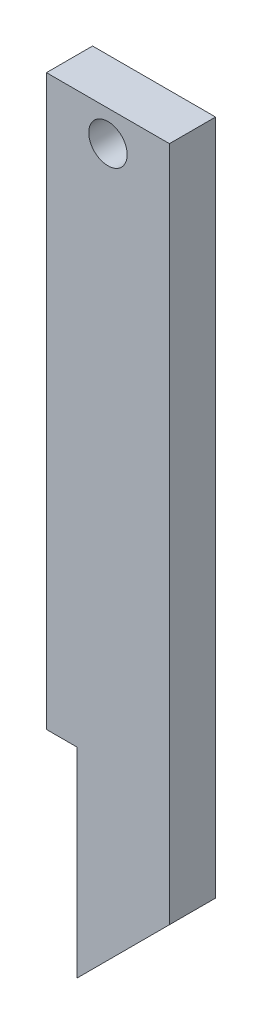
ISO-10303-21;
HEADER;
FILE_DESCRIPTION(('STEP AP214'),'2;1');
FILE_NAME('part.step','',(''),(''),'','','');
FILE_SCHEMA(('AUTOMOTIVE_DESIGN { 1 0 10303 214 1 1 1 1 }'));
ENDSEC;
DATA;
#1=APPLICATION_CONTEXT('core data for automotive mechanical design processes');
#2=APPLICATION_PROTOCOL_DEFINITION('international standard','automotive_design',2000,#1);
#3=PRODUCT_CONTEXT('',#1,'mechanical');
#4=PRODUCT('Part','Part','',(#3));
#5=PRODUCT_RELATED_PRODUCT_CATEGORY('part','',(#4));
#6=PRODUCT_DEFINITION_FORMATION('','',#4);
#7=PRODUCT_DEFINITION_CONTEXT('part definition',#1,'design');
#8=PRODUCT_DEFINITION('design','',#6,#7);
#9=PRODUCT_DEFINITION_SHAPE('','',#8);
#10=(LENGTH_UNIT() NAMED_UNIT(*) SI_UNIT(.MILLI.,.METRE.));
#11=(NAMED_UNIT(*) PLANE_ANGLE_UNIT() SI_UNIT($,.RADIAN.));
#12=(NAMED_UNIT(*) SI_UNIT($,.STERADIAN.) SOLID_ANGLE_UNIT());
#13=UNCERTAINTY_MEASURE_WITH_UNIT(LENGTH_MEASURE(1.E-05),#10,'distance_accuracy_value','');
#14=(GEOMETRIC_REPRESENTATION_CONTEXT(3) GLOBAL_UNCERTAINTY_ASSIGNED_CONTEXT((#13)) GLOBAL_UNIT_ASSIGNED_CONTEXT((#10,
#11,#12)) REPRESENTATION_CONTEXT('',''));
#15=CARTESIAN_POINT('',(0.,0.,0.));
#16=DIRECTION('',(0.,0.,1.));
#17=DIRECTION('',(1.,0.,0.));
#18=AXIS2_PLACEMENT_3D('',#15,#16,#17);
#19=CARTESIAN_POINT('',(-17.553498798299,42.9622619707894,3.));
#20=DIRECTION('',(0.,-1.,0.));
#21=DIRECTION('',(1.,0.,0.));
#22=AXIS2_PLACEMENT_3D('',#19,#20,#21);
#23=PLANE('',#22);
#24=DIRECTION('',(-1.,0.,0.));
#25=VECTOR('',#24,1.);
#26=CARTESIAN_POINT('',(-17.553498798299,42.9622619707894,0.));
#27=LINE('',#26,#25);
#28=CARTESIAN_POINT('',(-9.55349879829899,42.9622619707894,0.));
#29=VERTEX_POINT('',#28);
#30=CARTESIAN_POINT('',(-17.553498798299,42.9622619707894,0.));
#31=VERTEX_POINT('',#30);
#32=EDGE_CURVE('E120',#29,#31,#27,.T.);
#33=ORIENTED_EDGE('',*,*,#32,.T.);
#34=DIRECTION('',(0.,0.,-1.));
#35=VECTOR('',#34,1.);
#36=CARTESIAN_POINT('',(-17.553498798299,42.9622619707894,3.));
#37=LINE('',#36,#35);
#38=CARTESIAN_POINT('',(-17.553498798299,42.9622619707894,3.));
#39=VERTEX_POINT('',#38);
#40=EDGE_CURVE('E11',#39,#31,#37,.T.);
#41=ORIENTED_EDGE('',*,*,#40,.F.);
#42=DIRECTION('',(-1.,0.,0.));
#43=VECTOR('',#42,1.);
#44=CARTESIAN_POINT('',(-17.553498798299,42.9622619707894,3.));
#45=LINE('',#44,#43);
#46=CARTESIAN_POINT('',(-9.55349879829899,42.9622619707894,3.));
#47=VERTEX_POINT('',#46);
#48=EDGE_CURVE('E117',#47,#39,#45,.T.);
#49=ORIENTED_EDGE('',*,*,#48,.F.);
#50=DIRECTION('',(0.,0.,-1.));
#51=VECTOR('',#50,1.);
#52=CARTESIAN_POINT('',(-9.55349879829899,42.9622619707894,3.));
#53=LINE('',#52,#51);
#54=EDGE_CURVE('E124',#47,#29,#53,.T.);
#55=ORIENTED_EDGE('',*,*,#54,.T.);
#56=EDGE_LOOP('',(#33,#41,#49,#55));
#57=FACE_BOUND('',#56,.T.);
#58=ADVANCED_FACE('F33',(#57),#23,.F.);
#59=CARTESIAN_POINT('',(-17.553498798299,42.9622619707894,3.));
#60=DIRECTION('',(1.,0.,0.));
#61=DIRECTION('',(0.,1.,0.));
#62=AXIS2_PLACEMENT_3D('',#59,#60,#61);
#63=PLANE('',#62);
#64=DIRECTION('',(0.,-1.,0.));
#65=VECTOR('',#64,1.);
#66=CARTESIAN_POINT('',(-17.553498798299,42.9622619707894,0.));
#67=LINE('',#66,#65);
#68=CARTESIAN_POINT('',(-17.553498798299,5.96226197078943,0.));
#69=VERTEX_POINT('',#68);
#70=EDGE_CURVE('E115',#31,#69,#67,.T.);
#71=ORIENTED_EDGE('',*,*,#70,.T.);
#72=DIRECTION('',(0.,0.,1.));
#73=VECTOR('',#72,1.);
#74=CARTESIAN_POINT('',(-17.553498798299,5.96226197078943,0.));
#75=LINE('',#74,#73);
#76=CARTESIAN_POINT('',(-17.553498798299,5.96226197078943,3.));
#77=VERTEX_POINT('',#76);
#78=EDGE_CURVE('E139',#69,#77,#75,.T.);
#79=ORIENTED_EDGE('',*,*,#78,.T.);
#80=DIRECTION('',(0.,-1.,0.));
#81=VECTOR('',#80,1.);
#82=CARTESIAN_POINT('',(-17.553498798299,42.9622619707894,3.));
#83=LINE('',#82,#81);
#84=EDGE_CURVE('E79',#39,#77,#83,.T.);
#85=ORIENTED_EDGE('',*,*,#84,.F.);
#86=ORIENTED_EDGE('',*,*,#40,.T.);
#87=EDGE_LOOP('',(#71,#79,#85,#86));
#88=FACE_BOUND('',#87,.T.);
#89=ADVANCED_FACE('F145',(#88),#63,.F.);
#90=CARTESIAN_POINT('',(-17.553498798299,-9.03773802921057,3.));
#91=DIRECTION('',(-0.707106781186549,0.707106781186546,0.));
#92=DIRECTION('',(-0.707106781186546,-0.707106781186549,0.));
#93=AXIS2_PLACEMENT_3D('',#90,#91,#92);
#94=PLANE('',#93);
#95=DIRECTION('',(0.707106781186546,0.707106781186549,0.));
#96=VECTOR('',#95,1.);
#97=CARTESIAN_POINT('',(-17.553498798299,-9.03773802921057,3.));
#98=LINE('',#97,#96);
#99=CARTESIAN_POINT('',(-15.553498798299,-7.03773802921062,3.));
#100=VERTEX_POINT('',#99);
#101=CARTESIAN_POINT('',(-9.55349879829899,-1.03773802921057,3.));
#102=VERTEX_POINT('',#101);
#103=EDGE_CURVE('E110',#100,#102,#98,.T.);
#104=ORIENTED_EDGE('',*,*,#103,.F.);
#105=DIRECTION('',(0.,0.,1.));
#106=VECTOR('',#105,1.);
#107=CARTESIAN_POINT('',(-15.553498798299,-7.03773802921062,0.));
#108=LINE('',#107,#106);
#109=CARTESIAN_POINT('',(-15.553498798299,-7.03773802921062,0.));
#110=VERTEX_POINT('',#109);
#111=EDGE_CURVE('E98',#110,#100,#108,.T.);
#112=ORIENTED_EDGE('',*,*,#111,.F.);
#113=DIRECTION('',(0.707106781186546,0.707106781186549,0.));
#114=VECTOR('',#113,1.);
#115=CARTESIAN_POINT('',(-17.553498798299,-9.03773802921057,0.));
#116=LINE('',#115,#114);
#117=CARTESIAN_POINT('',(-9.55349879829899,-1.03773802921057,0.));
#118=VERTEX_POINT('',#117);
#119=EDGE_CURVE('E109',#110,#118,#116,.T.);
#120=ORIENTED_EDGE('',*,*,#119,.T.);
#121=DIRECTION('',(0.,0.,-1.));
#122=VECTOR('',#121,1.);
#123=CARTESIAN_POINT('',(-9.55349879829899,-1.03773802921057,3.));
#124=LINE('',#123,#122);
#125=EDGE_CURVE('E40',#102,#118,#124,.T.);
#126=ORIENTED_EDGE('',*,*,#125,.F.);
#127=EDGE_LOOP('',(#104,#112,#120,#126));
#128=FACE_BOUND('',#127,.T.);
#129=ADVANCED_FACE('F107',(#128),#94,.F.);
#130=CARTESIAN_POINT('',(-9.55349879829899,42.9622619707894,3.));
#131=DIRECTION('',(-1.,0.,0.));
#132=DIRECTION('',(0.,-1.,0.));
#133=AXIS2_PLACEMENT_3D('',#130,#131,#132);
#134=PLANE('',#133);
#135=DIRECTION('',(0.,1.,0.));
#136=VECTOR('',#135,1.);
#137=CARTESIAN_POINT('',(-9.55349879829899,42.9622619707894,0.));
#138=LINE('',#137,#136);
#139=EDGE_CURVE('E73',#118,#29,#138,.T.);
#140=ORIENTED_EDGE('',*,*,#139,.T.);
#141=ORIENTED_EDGE('',*,*,#54,.F.);
#142=DIRECTION('',(0.,1.,0.));
#143=VECTOR('',#142,1.);
#144=CARTESIAN_POINT('',(-9.55349879829899,42.9622619707894,3.));
#145=LINE('',#144,#143);
#146=EDGE_CURVE('E56',#102,#47,#145,.T.);
#147=ORIENTED_EDGE('',*,*,#146,.F.);
#148=ORIENTED_EDGE('',*,*,#125,.T.);
#149=EDGE_LOOP('',(#140,#141,#147,#148));
#150=FACE_BOUND('',#149,.T.);
#151=ADVANCED_FACE('F125',(#150),#134,.F.);
#152=CARTESIAN_POINT('',(0.,0.,3.));
#153=DIRECTION('',(0.,0.,-1.));
#154=DIRECTION('',(-1.,0.,0.));
#155=AXIS2_PLACEMENT_3D('',#152,#153,#154);
#156=PLANE('',#155);
#157=CARTESIAN_POINT('',(-13.5534987982991,40.9622619707894,3.));
#158=DIRECTION('',(0.,0.,1.));
#159=DIRECTION('',(1.,0.,0.));
#160=AXIS2_PLACEMENT_3D('',#157,#158,#159);
#161=CIRCLE('',#160,1.25);
#162=CARTESIAN_POINT('',(-12.3034987982991,40.9622619707894,3.));
#163=VERTEX_POINT('',#162);
#164=EDGE_CURVE('E135',#163,#163,#161,.T.);
#165=ORIENTED_EDGE('',*,*,#164,.F.);
#166=EDGE_LOOP('',(#165));
#167=FACE_BOUND('',#166,.T.);
#168=ORIENTED_EDGE('',*,*,#84,.T.);
#169=DIRECTION('',(-1.,0.,0.));
#170=VECTOR('',#169,1.);
#171=CARTESIAN_POINT('',(-17.553498798299,5.96226197078943,3.));
#172=LINE('',#171,#170);
#173=CARTESIAN_POINT('',(-15.553498798299,5.96226197078943,3.));
#174=VERTEX_POINT('',#173);
#175=EDGE_CURVE('E103',#174,#77,#172,.T.);
#176=ORIENTED_EDGE('',*,*,#175,.F.);
#177=DIRECTION('',(0.,1.,0.));
#178=VECTOR('',#177,1.);
#179=CARTESIAN_POINT('',(-15.553498798299,5.96226197078943,3.));
#180=LINE('',#179,#178);
#181=EDGE_CURVE('E148',#100,#174,#180,.T.);
#182=ORIENTED_EDGE('',*,*,#181,.F.);
#183=ORIENTED_EDGE('',*,*,#103,.T.);
#184=ORIENTED_EDGE('',*,*,#146,.T.);
#185=ORIENTED_EDGE('',*,*,#48,.T.);
#186=EDGE_LOOP('',(#168,#176,#182,#183,#184,#185));
#187=FACE_BOUND('',#186,.T.);
#188=ADVANCED_FACE('F144',(#167,#187),#156,.F.);
#189=CARTESIAN_POINT('',(0.,0.,0.));
#190=DIRECTION('',(0.,0.,-1.));
#191=DIRECTION('',(-1.,0.,0.));
#192=AXIS2_PLACEMENT_3D('',#189,#190,#191);
#193=PLANE('',#192);
#194=DIRECTION('',(-1.,0.,0.));
#195=VECTOR('',#194,1.);
#196=CARTESIAN_POINT('',(-17.553498798299,5.96226197078943,0.));
#197=LINE('',#196,#195);
#198=CARTESIAN_POINT('',(-15.553498798299,5.96226197078943,0.));
#199=VERTEX_POINT('',#198);
#200=EDGE_CURVE('E47',#199,#69,#197,.T.);
#201=ORIENTED_EDGE('',*,*,#200,.T.);
#202=ORIENTED_EDGE('',*,*,#70,.F.);
#203=ORIENTED_EDGE('',*,*,#32,.F.);
#204=ORIENTED_EDGE('',*,*,#139,.F.);
#205=ORIENTED_EDGE('',*,*,#119,.F.);
#206=DIRECTION('',(0.,1.,0.));
#207=VECTOR('',#206,1.);
#208=CARTESIAN_POINT('',(-15.553498798299,5.96226197078943,0.));
#209=LINE('',#208,#207);
#210=EDGE_CURVE('E94',#110,#199,#209,.T.);
#211=ORIENTED_EDGE('',*,*,#210,.T.);
#212=EDGE_LOOP('',(#201,#202,#203,#204,#205,#211));
#213=FACE_BOUND('',#212,.T.);
#214=CARTESIAN_POINT('',(-13.5534987982991,40.9622619707894,0.));
#215=DIRECTION('',(0.,0.,1.));
#216=DIRECTION('',(1.,0.,0.));
#217=AXIS2_PLACEMENT_3D('',#214,#215,#216);
#218=CIRCLE('',#217,1.25);
#219=CARTESIAN_POINT('',(-12.3034987982991,40.9622619707894,0.));
#220=VERTEX_POINT('',#219);
#221=EDGE_CURVE('E131',#220,#220,#218,.T.);
#222=ORIENTED_EDGE('',*,*,#221,.T.);
#223=EDGE_LOOP('',(#222));
#224=FACE_BOUND('',#223,.T.);
#225=ADVANCED_FACE('F112',(#213,#224),#193,.T.);
#226=CARTESIAN_POINT('',(-13.5534987982991,40.9622619707894,0.));
#227=DIRECTION('',(0.,0.,1.));
#228=DIRECTION('',(1.,0.,0.));
#229=AXIS2_PLACEMENT_3D('',#226,#227,#228);
#230=CYLINDRICAL_SURFACE('',#229,1.25);
#231=ORIENTED_EDGE('',*,*,#221,.F.);
#232=EDGE_LOOP('',(#231));
#233=FACE_BOUND('',#232,.T.);
#234=ORIENTED_EDGE('',*,*,#164,.T.);
#235=EDGE_LOOP('',(#234));
#236=FACE_BOUND('',#235,.T.);
#237=ADVANCED_FACE('F153',(#233,#236),#230,.F.);
#238=CARTESIAN_POINT('',(-17.553498798299,5.96226197078943,0.));
#239=DIRECTION('',(0.,1.,0.));
#240=DIRECTION('',(0.,0.,1.));
#241=AXIS2_PLACEMENT_3D('',#238,#239,#240);
#242=PLANE('',#241);
#243=ORIENTED_EDGE('',*,*,#175,.T.);
#244=ORIENTED_EDGE('',*,*,#78,.F.);
#245=ORIENTED_EDGE('',*,*,#200,.F.);
#246=DIRECTION('',(0.,0.,1.));
#247=VECTOR('',#246,1.);
#248=CARTESIAN_POINT('',(-15.553498798299,5.96226197078943,0.));
#249=LINE('',#248,#247);
#250=EDGE_CURVE('E100',#199,#174,#249,.T.);
#251=ORIENTED_EDGE('',*,*,#250,.T.);
#252=EDGE_LOOP('',(#243,#244,#245,#251));
#253=FACE_BOUND('',#252,.T.);
#254=ADVANCED_FACE('F151',(#253),#242,.F.);
#255=CARTESIAN_POINT('',(-15.553498798299,5.96226197078943,0.));
#256=DIRECTION('',(1.,0.,0.));
#257=DIRECTION('',(0.,1.,0.));
#258=AXIS2_PLACEMENT_3D('',#255,#256,#257);
#259=PLANE('',#258);
#260=ORIENTED_EDGE('',*,*,#181,.T.);
#261=ORIENTED_EDGE('',*,*,#250,.F.);
#262=ORIENTED_EDGE('',*,*,#210,.F.);
#263=ORIENTED_EDGE('',*,*,#111,.T.);
#264=EDGE_LOOP('',(#260,#261,#262,#263));
#265=FACE_BOUND('',#264,.T.);
#266=ADVANCED_FACE('F97',(#265),#259,.F.);
#267=CLOSED_SHELL('',(#58,#89,#129,#151,#188,#225,#237,#254,#266));
#268=MANIFOLD_SOLID_BREP('B2',#267);
#269=ADVANCED_BREP_SHAPE_REPRESENTATION('',(#18,#268),#14);
#270=SHAPE_DEFINITION_REPRESENTATION(#9,#269);
ENDSEC;
END-ISO-10303-21;
